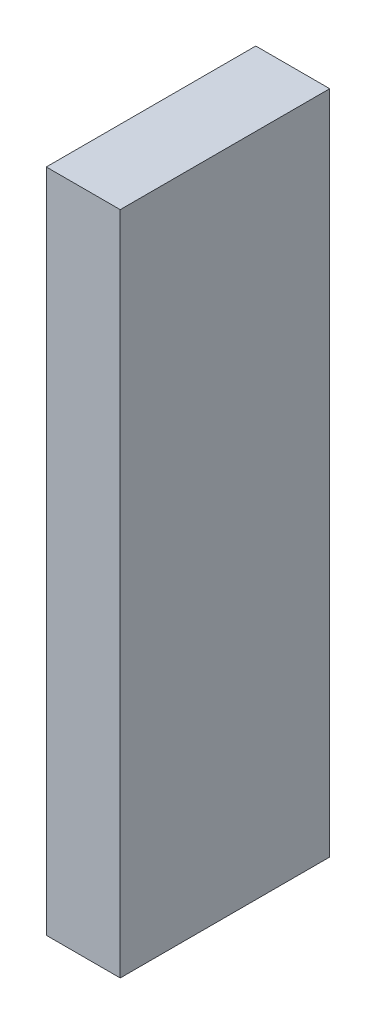
ISO-10303-21;
HEADER;
FILE_DESCRIPTION(('STEP AP214'),'2;1');
FILE_NAME('part.step','',(''),(''),'','','');
FILE_SCHEMA(('AUTOMOTIVE_DESIGN { 1 0 10303 214 1 1 1 1 }'));
ENDSEC;
DATA;
#1=APPLICATION_CONTEXT('core data for automotive mechanical design processes');
#2=APPLICATION_PROTOCOL_DEFINITION('international standard','automotive_design',2000,#1);
#3=PRODUCT_CONTEXT('',#1,'mechanical');
#4=PRODUCT('Part','Part','',(#3));
#5=PRODUCT_RELATED_PRODUCT_CATEGORY('part','',(#4));
#6=PRODUCT_DEFINITION_FORMATION('','',#4);
#7=PRODUCT_DEFINITION_CONTEXT('part definition',#1,'design');
#8=PRODUCT_DEFINITION('design','',#6,#7);
#9=PRODUCT_DEFINITION_SHAPE('','',#8);
#10=(LENGTH_UNIT() NAMED_UNIT(*) SI_UNIT(.MILLI.,.METRE.));
#11=(NAMED_UNIT(*) PLANE_ANGLE_UNIT() SI_UNIT($,.RADIAN.));
#12=(NAMED_UNIT(*) SI_UNIT($,.STERADIAN.) SOLID_ANGLE_UNIT());
#13=UNCERTAINTY_MEASURE_WITH_UNIT(LENGTH_MEASURE(1.E-05),#10,'distance_accuracy_value','');
#14=(GEOMETRIC_REPRESENTATION_CONTEXT(3) GLOBAL_UNCERTAINTY_ASSIGNED_CONTEXT((#13)) GLOBAL_UNIT_ASSIGNED_CONTEXT((#10,
#11,#12)) REPRESENTATION_CONTEXT('',''));
#15=CARTESIAN_POINT('',(0.,0.,0.));
#16=DIRECTION('',(0.,0.,1.));
#17=DIRECTION('',(1.,0.,0.));
#18=AXIS2_PLACEMENT_3D('',#15,#16,#17);
#19=CARTESIAN_POINT('',(-3.0499940983365,2.69999872159531,0.));
#20=DIRECTION('',(-1.,8.74227765734759E-08,0.));
#21=DIRECTION('',(-8.74227765734759E-08,-1.,0.));
#22=AXIS2_PLACEMENT_3D('',#19,#20,#21);
#23=PLANE('',#22);
#24=DIRECTION('',(-8.74227765512293E-08,-0.999999999999996,0.));
#25=VECTOR('',#24,1.);
#26=CARTESIAN_POINT('',(-3.0499940983365,2.69999872159531,0.));
#27=LINE('',#26,#25);
#28=CARTESIAN_POINT('',(-3.0499940983365,2.69999872159531,0.));
#29=VERTEX_POINT('',#28);
#30=CARTESIAN_POINT('',(-3.04999457041896,-2.69999517488907,0.));
#31=VERTEX_POINT('',#30);
#32=EDGE_CURVE('E11',#29,#31,#27,.T.);
#33=ORIENTED_EDGE('',*,*,#32,.T.);
#34=DIRECTION('',(0.,0.,1.));
#35=VECTOR('',#34,1.);
#36=CARTESIAN_POINT('',(-3.04999457041896,-2.69999517488907,0.));
#37=LINE('',#36,#35);
#38=CARTESIAN_POINT('',(-3.04999457041896,-2.69999517488907,1.6999990940094));
#39=VERTEX_POINT('',#38);
#40=EDGE_CURVE('E88',#31,#39,#37,.T.);
#41=ORIENTED_EDGE('',*,*,#40,.T.);
#42=DIRECTION('',(-8.74227765512293E-08,-0.999999999999996,0.));
#43=VECTOR('',#42,1.);
#44=CARTESIAN_POINT('',(-3.0499940983365,2.69999872159531,1.6999990940094));
#45=LINE('',#44,#43);
#46=CARTESIAN_POINT('',(-3.0499940983365,2.69999872159531,1.6999990940094));
#47=VERTEX_POINT('',#46);
#48=EDGE_CURVE('E83',#47,#39,#45,.T.);
#49=ORIENTED_EDGE('',*,*,#48,.F.);
#50=DIRECTION('',(0.,0.,1.));
#51=VECTOR('',#50,1.);
#52=CARTESIAN_POINT('',(-3.0499940983365,2.69999872159531,0.));
#53=LINE('',#52,#51);
#54=EDGE_CURVE('E72',#29,#47,#53,.T.);
#55=ORIENTED_EDGE('',*,*,#54,.F.);
#56=EDGE_LOOP('',(#33,#41,#49,#55));
#57=FACE_BOUND('',#56,.T.);
#58=ADVANCED_FACE('F17',(#57),#23,.T.);
#59=CARTESIAN_POINT('',(-3.04999457041896,-2.69999517488907,0.));
#60=DIRECTION('',(-8.74227765734759E-08,-1.,0.));
#61=DIRECTION('',(1.,-8.74227765734759E-08,0.));
#62=AXIS2_PLACEMENT_3D('',#59,#60,#61);
#63=PLANE('',#62);
#64=DIRECTION('',(0.999999999999996,-8.74227766432269E-08,0.));
#65=VECTOR('',#64,1.);
#66=CARTESIAN_POINT('',(-3.04999457041896,-2.69999517488907,0.));
#67=LINE('',#66,#65);
#68=CARTESIAN_POINT('',(-2.4500037256924,-2.69999522734193,0.));
#69=VERTEX_POINT('',#68);
#70=EDGE_CURVE('E24',#31,#69,#67,.T.);
#71=ORIENTED_EDGE('',*,*,#70,.T.);
#72=DIRECTION('',(0.,0.,1.));
#73=VECTOR('',#72,1.);
#74=CARTESIAN_POINT('',(-2.4500037256924,-2.69999522734193,0.));
#75=LINE('',#74,#73);
#76=CARTESIAN_POINT('',(-2.4500037256924,-2.69999522734193,1.6999990940094));
#77=VERTEX_POINT('',#76);
#78=EDGE_CURVE('E85',#69,#77,#75,.T.);
#79=ORIENTED_EDGE('',*,*,#78,.T.);
#80=DIRECTION('',(0.999999999999996,-8.74227766432269E-08,0.));
#81=VECTOR('',#80,1.);
#82=CARTESIAN_POINT('',(-3.04999457041896,-2.69999517488907,1.6999990940094));
#83=LINE('',#82,#81);
#84=EDGE_CURVE('E66',#39,#77,#83,.T.);
#85=ORIENTED_EDGE('',*,*,#84,.F.);
#86=ORIENTED_EDGE('',*,*,#40,.F.);
#87=EDGE_LOOP('',(#71,#79,#85,#86));
#88=FACE_BOUND('',#87,.T.);
#89=ADVANCED_FACE('F89',(#88),#63,.T.);
#90=CARTESIAN_POINT('',(-2.4500037256924,-2.69999522734193,0.));
#91=DIRECTION('',(1.,-8.74227765734759E-08,0.));
#92=DIRECTION('',(8.74227765734759E-08,1.,0.));
#93=AXIS2_PLACEMENT_3D('',#90,#91,#92);
#94=PLANE('',#93);
#95=DIRECTION('',(8.74227765512293E-08,0.999999999999996,0.));
#96=VECTOR('',#95,1.);
#97=CARTESIAN_POINT('',(-2.4500037256924,-2.69999522734193,0.));
#98=LINE('',#97,#96);
#99=CARTESIAN_POINT('',(-2.45000325360994,2.69999866914245,0.));
#100=VERTEX_POINT('',#99);
#101=EDGE_CURVE('E62',#69,#100,#98,.T.);
#102=ORIENTED_EDGE('',*,*,#101,.T.);
#103=DIRECTION('',(0.,0.,1.));
#104=VECTOR('',#103,1.);
#105=CARTESIAN_POINT('',(-2.45000325360994,2.69999866914245,0.));
#106=LINE('',#105,#104);
#107=CARTESIAN_POINT('',(-2.45000325360994,2.69999866914245,1.6999990940094));
#108=VERTEX_POINT('',#107);
#109=EDGE_CURVE('E55',#100,#108,#106,.T.);
#110=ORIENTED_EDGE('',*,*,#109,.T.);
#111=DIRECTION('',(8.74227765512293E-08,0.999999999999996,0.));
#112=VECTOR('',#111,1.);
#113=CARTESIAN_POINT('',(-2.4500037256924,-2.69999522734193,1.6999990940094));
#114=LINE('',#113,#112);
#115=EDGE_CURVE('E59',#77,#108,#114,.T.);
#116=ORIENTED_EDGE('',*,*,#115,.F.);
#117=ORIENTED_EDGE('',*,*,#78,.F.);
#118=EDGE_LOOP('',(#102,#110,#116,#117));
#119=FACE_BOUND('',#118,.T.);
#120=ADVANCED_FACE('F57',(#119),#94,.T.);
#121=CARTESIAN_POINT('',(-2.45000325360994,2.69999866914245,0.));
#122=DIRECTION('',(8.74227765734759E-08,1.,0.));
#123=DIRECTION('',(-1.,8.74227765734759E-08,0.));
#124=AXIS2_PLACEMENT_3D('',#121,#122,#123);
#125=PLANE('',#124);
#126=DIRECTION('',(-0.999999999999996,8.74227766432269E-08,0.));
#127=VECTOR('',#126,1.);
#128=CARTESIAN_POINT('',(-2.45000325360994,2.69999866914245,0.));
#129=LINE('',#128,#127);
#130=EDGE_CURVE('E65',#100,#29,#129,.T.);
#131=ORIENTED_EDGE('',*,*,#130,.T.);
#132=ORIENTED_EDGE('',*,*,#54,.T.);
#133=DIRECTION('',(-0.999999999999996,8.74227766432269E-08,0.));
#134=VECTOR('',#133,1.);
#135=CARTESIAN_POINT('',(-2.45000325360994,2.69999866914245,1.6999990940094));
#136=LINE('',#135,#134);
#137=EDGE_CURVE('E70',#108,#47,#136,.T.);
#138=ORIENTED_EDGE('',*,*,#137,.F.);
#139=ORIENTED_EDGE('',*,*,#109,.F.);
#140=EDGE_LOOP('',(#131,#132,#138,#139));
#141=FACE_BOUND('',#140,.T.);
#142=ADVANCED_FACE('F71',(#141),#125,.T.);
#143=CARTESIAN_POINT('',(191.775009155273,74.8249816894531,1.6999990940094));
#144=DIRECTION('',(0.,0.,1.));
#145=DIRECTION('',(-1.,8.74227765734759E-08,0.));
#146=AXIS2_PLACEMENT_3D('',#143,#144,#145);
#147=PLANE('',#146);
#148=ORIENTED_EDGE('',*,*,#48,.T.);
#149=ORIENTED_EDGE('',*,*,#84,.T.);
#150=ORIENTED_EDGE('',*,*,#115,.T.);
#151=ORIENTED_EDGE('',*,*,#137,.T.);
#152=EDGE_LOOP('',(#148,#149,#150,#151));
#153=FACE_BOUND('',#152,.T.);
#154=ADVANCED_FACE('F76',(#153),#147,.T.);
#155=CARTESIAN_POINT('',(191.775009155273,74.8249816894531,0.));
#156=DIRECTION('',(0.,0.,1.));
#157=DIRECTION('',(-1.,8.74227765734759E-08,0.));
#158=AXIS2_PLACEMENT_3D('',#155,#156,#157);
#159=PLANE('',#158);
#160=ORIENTED_EDGE('',*,*,#130,.F.);
#161=ORIENTED_EDGE('',*,*,#101,.F.);
#162=ORIENTED_EDGE('',*,*,#70,.F.);
#163=ORIENTED_EDGE('',*,*,#32,.F.);
#164=EDGE_LOOP('',(#160,#161,#162,#163));
#165=FACE_BOUND('',#164,.T.);
#166=ADVANCED_FACE('F91',(#165),#159,.F.);
#167=CLOSED_SHELL('',(#58,#89,#120,#142,#154,#166));
#168=MANIFOLD_SOLID_BREP('B1',#167);
#169=ADVANCED_BREP_SHAPE_REPRESENTATION('',(#18,#168),#14);
#170=SHAPE_DEFINITION_REPRESENTATION(#9,#169);
ENDSEC;
END-ISO-10303-21;
